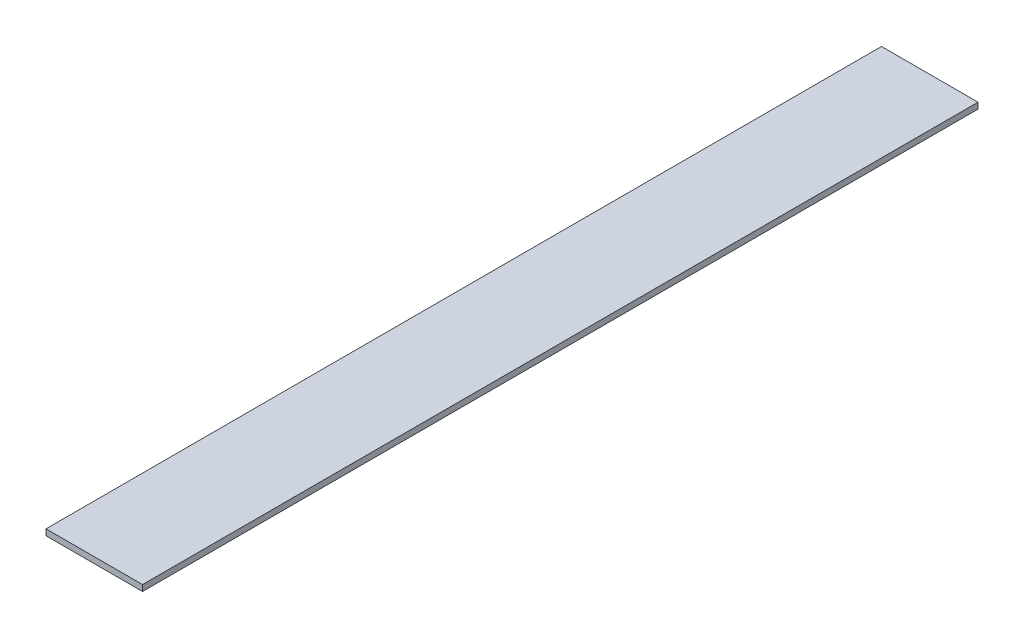
ISO-10303-21;
HEADER;
FILE_DESCRIPTION(('STEP AP214'),'2;1');
FILE_NAME('part.step','',(''),(''),'','','');
FILE_SCHEMA(('AUTOMOTIVE_DESIGN { 1 0 10303 214 1 1 1 1 }'));
ENDSEC;
DATA;
#1=APPLICATION_CONTEXT('core data for automotive mechanical design processes');
#2=APPLICATION_PROTOCOL_DEFINITION('international standard','automotive_design',2000,#1);
#3=PRODUCT_CONTEXT('',#1,'mechanical');
#4=PRODUCT('Part','Part','',(#3));
#5=PRODUCT_RELATED_PRODUCT_CATEGORY('part','',(#4));
#6=PRODUCT_DEFINITION_FORMATION('','',#4);
#7=PRODUCT_DEFINITION_CONTEXT('part definition',#1,'design');
#8=PRODUCT_DEFINITION('design','',#6,#7);
#9=PRODUCT_DEFINITION_SHAPE('','',#8);
#10=(LENGTH_UNIT() NAMED_UNIT(*) SI_UNIT(.MILLI.,.METRE.));
#11=(NAMED_UNIT(*) PLANE_ANGLE_UNIT() SI_UNIT($,.RADIAN.));
#12=(NAMED_UNIT(*) SI_UNIT($,.STERADIAN.) SOLID_ANGLE_UNIT());
#13=UNCERTAINTY_MEASURE_WITH_UNIT(LENGTH_MEASURE(1.E-05),#10,'distance_accuracy_value','');
#14=(GEOMETRIC_REPRESENTATION_CONTEXT(3) GLOBAL_UNCERTAINTY_ASSIGNED_CONTEXT((#13)) GLOBAL_UNIT_ASSIGNED_CONTEXT((#10,
#11,#12)) REPRESENTATION_CONTEXT('',''));
#15=CARTESIAN_POINT('',(0.,0.,0.));
#16=DIRECTION('',(0.,0.,1.));
#17=DIRECTION('',(1.,0.,0.));
#18=AXIS2_PLACEMENT_3D('',#15,#16,#17);
#19=CARTESIAN_POINT('',(25.4,3.175,-219.86875));
#20=DIRECTION('',(-1.,0.,0.));
#21=DIRECTION('',(0.,0.,1.));
#22=AXIS2_PLACEMENT_3D('',#19,#20,#21);
#23=PLANE('',#22);
#24=DIRECTION('',(0.,0.,-1.));
#25=VECTOR('',#24,1.);
#26=CARTESIAN_POINT('',(25.4,0.,-219.86875));
#27=LINE('',#26,#25);
#28=CARTESIAN_POINT('',(25.4,0.,219.86875));
#29=VERTEX_POINT('',#28);
#30=CARTESIAN_POINT('',(25.4,0.,-219.86875));
#31=VERTEX_POINT('',#30);
#32=EDGE_CURVE('E95',#29,#31,#27,.T.);
#33=ORIENTED_EDGE('',*,*,#32,.T.);
#34=DIRECTION('',(0.,-1.,0.));
#35=VECTOR('',#34,1.);
#36=CARTESIAN_POINT('',(25.4,3.175,-219.86875));
#37=LINE('',#36,#35);
#38=CARTESIAN_POINT('',(25.4,3.175,-219.86875));
#39=VERTEX_POINT('',#38);
#40=EDGE_CURVE('E11',#39,#31,#37,.T.);
#41=ORIENTED_EDGE('',*,*,#40,.F.);
#42=DIRECTION('',(0.,0.,-1.));
#43=VECTOR('',#42,1.);
#44=CARTESIAN_POINT('',(25.4,3.175,-219.86875));
#45=LINE('',#44,#43);
#46=CARTESIAN_POINT('',(25.4,3.175,219.86875));
#47=VERTEX_POINT('',#46);
#48=EDGE_CURVE('E83',#47,#39,#45,.T.);
#49=ORIENTED_EDGE('',*,*,#48,.F.);
#50=DIRECTION('',(0.,-1.,0.));
#51=VECTOR('',#50,1.);
#52=CARTESIAN_POINT('',(25.4,3.175,219.86875));
#53=LINE('',#52,#51);
#54=EDGE_CURVE('E91',#47,#29,#53,.T.);
#55=ORIENTED_EDGE('',*,*,#54,.T.);
#56=EDGE_LOOP('',(#33,#41,#49,#55));
#57=FACE_BOUND('',#56,.T.);
#58=ADVANCED_FACE('F32',(#57),#23,.F.);
#59=CARTESIAN_POINT('',(-25.4,3.175,-219.86875));
#60=DIRECTION('',(0.,0.,1.));
#61=DIRECTION('',(1.,0.,0.));
#62=AXIS2_PLACEMENT_3D('',#59,#60,#61);
#63=PLANE('',#62);
#64=DIRECTION('',(-1.,0.,0.));
#65=VECTOR('',#64,1.);
#66=CARTESIAN_POINT('',(-25.4,0.,-219.86875));
#67=LINE('',#66,#65);
#68=CARTESIAN_POINT('',(-25.4,0.,-219.86875));
#69=VERTEX_POINT('',#68);
#70=EDGE_CURVE('E87',#31,#69,#67,.T.);
#71=ORIENTED_EDGE('',*,*,#70,.T.);
#72=DIRECTION('',(0.,-1.,0.));
#73=VECTOR('',#72,1.);
#74=CARTESIAN_POINT('',(-25.4,3.175,-219.86875));
#75=LINE('',#74,#73);
#76=CARTESIAN_POINT('',(-25.4,3.175,-219.86875));
#77=VERTEX_POINT('',#76);
#78=EDGE_CURVE('E40',#77,#69,#75,.T.);
#79=ORIENTED_EDGE('',*,*,#78,.F.);
#80=DIRECTION('',(-1.,0.,0.));
#81=VECTOR('',#80,1.);
#82=CARTESIAN_POINT('',(-25.4,3.175,-219.86875));
#83=LINE('',#82,#81);
#84=EDGE_CURVE('E78',#39,#77,#83,.T.);
#85=ORIENTED_EDGE('',*,*,#84,.F.);
#86=ORIENTED_EDGE('',*,*,#40,.T.);
#87=EDGE_LOOP('',(#71,#79,#85,#86));
#88=FACE_BOUND('',#87,.T.);
#89=ADVANCED_FACE('F86',(#88),#63,.F.);
#90=CARTESIAN_POINT('',(-25.4,3.175,-219.86875));
#91=DIRECTION('',(1.,0.,0.));
#92=DIRECTION('',(0.,0.,-1.));
#93=AXIS2_PLACEMENT_3D('',#90,#91,#92);
#94=PLANE('',#93);
#95=DIRECTION('',(0.,0.,1.));
#96=VECTOR('',#95,1.);
#97=CARTESIAN_POINT('',(-25.4,0.,-219.86875));
#98=LINE('',#97,#96);
#99=CARTESIAN_POINT('',(-25.4,0.,219.86875));
#100=VERTEX_POINT('',#99);
#101=EDGE_CURVE('E65',#69,#100,#98,.T.);
#102=ORIENTED_EDGE('',*,*,#101,.T.);
#103=DIRECTION('',(0.,-1.,0.));
#104=VECTOR('',#103,1.);
#105=CARTESIAN_POINT('',(-25.4,3.175,219.86875));
#106=LINE('',#105,#104);
#107=CARTESIAN_POINT('',(-25.4,3.175,219.86875));
#108=VERTEX_POINT('',#107);
#109=EDGE_CURVE('E88',#108,#100,#106,.T.);
#110=ORIENTED_EDGE('',*,*,#109,.F.);
#111=DIRECTION('',(0.,0.,1.));
#112=VECTOR('',#111,1.);
#113=CARTESIAN_POINT('',(-25.4,3.175,-219.86875));
#114=LINE('',#113,#112);
#115=EDGE_CURVE('E81',#77,#108,#114,.T.);
#116=ORIENTED_EDGE('',*,*,#115,.F.);
#117=ORIENTED_EDGE('',*,*,#78,.T.);
#118=EDGE_LOOP('',(#102,#110,#116,#117));
#119=FACE_BOUND('',#118,.T.);
#120=ADVANCED_FACE('F89',(#119),#94,.F.);
#121=CARTESIAN_POINT('',(-25.4,3.175,219.86875));
#122=DIRECTION('',(0.,0.,-1.));
#123=DIRECTION('',(-1.,0.,0.));
#124=AXIS2_PLACEMENT_3D('',#121,#122,#123);
#125=PLANE('',#124);
#126=DIRECTION('',(1.,0.,0.));
#127=VECTOR('',#126,1.);
#128=CARTESIAN_POINT('',(-25.4,0.,219.86875));
#129=LINE('',#128,#127);
#130=EDGE_CURVE('E71',#100,#29,#129,.T.);
#131=ORIENTED_EDGE('',*,*,#130,.T.);
#132=ORIENTED_EDGE('',*,*,#54,.F.);
#133=DIRECTION('',(1.,0.,0.));
#134=VECTOR('',#133,1.);
#135=CARTESIAN_POINT('',(-25.4,3.175,219.86875));
#136=LINE('',#135,#134);
#137=EDGE_CURVE('E48',#108,#47,#136,.T.);
#138=ORIENTED_EDGE('',*,*,#137,.F.);
#139=ORIENTED_EDGE('',*,*,#109,.T.);
#140=EDGE_LOOP('',(#131,#132,#138,#139));
#141=FACE_BOUND('',#140,.T.);
#142=ADVANCED_FACE('F102',(#141),#125,.F.);
#143=CARTESIAN_POINT('',(0.,3.175,0.));
#144=DIRECTION('',(0.,1.,0.));
#145=DIRECTION('',(0.,0.,1.));
#146=AXIS2_PLACEMENT_3D('',#143,#144,#145);
#147=PLANE('',#146);
#148=ORIENTED_EDGE('',*,*,#48,.T.);
#149=ORIENTED_EDGE('',*,*,#84,.T.);
#150=ORIENTED_EDGE('',*,*,#115,.T.);
#151=ORIENTED_EDGE('',*,*,#137,.T.);
#152=EDGE_LOOP('',(#148,#149,#150,#151));
#153=FACE_BOUND('',#152,.T.);
#154=ADVANCED_FACE('F79',(#153),#147,.T.);
#155=CARTESIAN_POINT('',(0.,0.,0.));
#156=DIRECTION('',(0.,1.,0.));
#157=DIRECTION('',(0.,0.,1.));
#158=AXIS2_PLACEMENT_3D('',#155,#156,#157);
#159=PLANE('',#158);
#160=ORIENTED_EDGE('',*,*,#32,.F.);
#161=ORIENTED_EDGE('',*,*,#130,.F.);
#162=ORIENTED_EDGE('',*,*,#101,.F.);
#163=ORIENTED_EDGE('',*,*,#70,.F.);
#164=EDGE_LOOP('',(#160,#161,#162,#163));
#165=FACE_BOUND('',#164,.T.);
#166=ADVANCED_FACE('F105',(#165),#159,.F.);
#167=CLOSED_SHELL('',(#58,#89,#120,#142,#154,#166));
#168=MANIFOLD_SOLID_BREP('B2',#167);
#169=ADVANCED_BREP_SHAPE_REPRESENTATION('',(#18,#168),#14);
#170=SHAPE_DEFINITION_REPRESENTATION(#9,#169);
ENDSEC;
END-ISO-10303-21;
